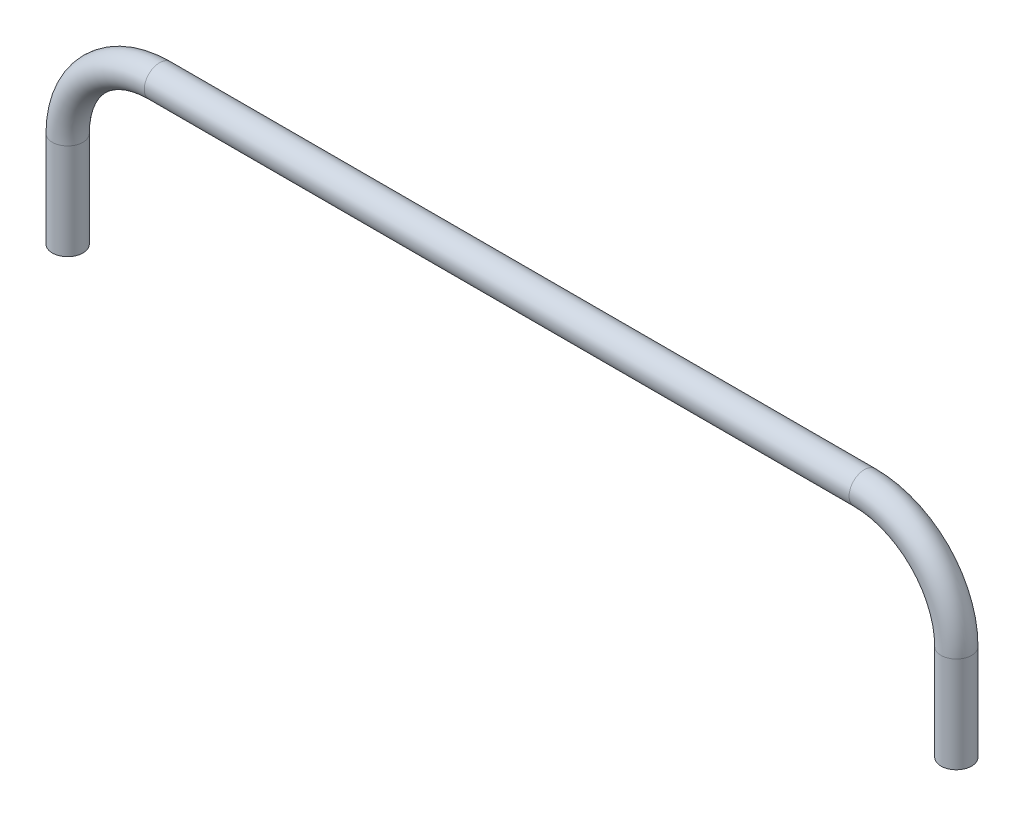
ISO-10303-21;
HEADER;
FILE_DESCRIPTION(('STEP AP214'),'2;1');
FILE_NAME('part.step','',(''),(''),'','','');
FILE_SCHEMA(('AUTOMOTIVE_DESIGN { 1 0 10303 214 1 1 1 1 }'));
ENDSEC;
DATA;
#1=APPLICATION_CONTEXT('core data for automotive mechanical design processes');
#2=APPLICATION_PROTOCOL_DEFINITION('international standard','automotive_design',2000,#1);
#3=PRODUCT_CONTEXT('',#1,'mechanical');
#4=PRODUCT('Part','Part','',(#3));
#5=PRODUCT_RELATED_PRODUCT_CATEGORY('part','',(#4));
#6=PRODUCT_DEFINITION_FORMATION('','',#4);
#7=PRODUCT_DEFINITION_CONTEXT('part definition',#1,'design');
#8=PRODUCT_DEFINITION('design','',#6,#7);
#9=PRODUCT_DEFINITION_SHAPE('','',#8);
#10=(LENGTH_UNIT() NAMED_UNIT(*) SI_UNIT(.MILLI.,.METRE.));
#11=(NAMED_UNIT(*) PLANE_ANGLE_UNIT() SI_UNIT($,.RADIAN.));
#12=(NAMED_UNIT(*) SI_UNIT($,.STERADIAN.) SOLID_ANGLE_UNIT());
#13=UNCERTAINTY_MEASURE_WITH_UNIT(LENGTH_MEASURE(1.E-05),#10,'distance_accuracy_value','');
#14=(GEOMETRIC_REPRESENTATION_CONTEXT(3) GLOBAL_UNCERTAINTY_ASSIGNED_CONTEXT((#13)) GLOBAL_UNIT_ASSIGNED_CONTEXT((#10,
#11,#12)) REPRESENTATION_CONTEXT('',''));
#15=CARTESIAN_POINT('',(0.,0.,0.));
#16=DIRECTION('',(0.,0.,1.));
#17=DIRECTION('',(1.,0.,0.));
#18=AXIS2_PLACEMENT_3D('',#15,#16,#17);
#19=CARTESIAN_POINT('',(0.,0.,0.));
#20=DIRECTION('',(0.,1.,0.));
#21=DIRECTION('',(0.,0.,1.));
#22=AXIS2_PLACEMENT_3D('',#19,#20,#21);
#23=CYLINDRICAL_SURFACE('',#22,12.7);
#24=CARTESIAN_POINT('',(0.,79.502,0.));
#25=DIRECTION('',(0.,1.,0.));
#26=DIRECTION('',(0.,0.,1.));
#27=AXIS2_PLACEMENT_3D('',#24,#25,#26);
#28=CIRCLE('',#27,12.7);
#29=CARTESIAN_POINT('',(-12.7,79.502,0.));
#30=VERTEX_POINT('',#29);
#31=EDGE_CURVE('E96',#30,#30,#28,.T.);
#32=ORIENTED_EDGE('',*,*,#31,.F.);
#33=EDGE_LOOP('',(#32));
#34=FACE_BOUND('',#33,.T.);
#35=CARTESIAN_POINT('',(0.,0.,0.));
#36=DIRECTION('',(0.,1.,0.));
#37=DIRECTION('',(0.,0.,1.));
#38=AXIS2_PLACEMENT_3D('',#35,#36,#37);
#39=CIRCLE('',#38,12.7);
#40=CARTESIAN_POINT('',(0.,0.,12.7));
#41=VERTEX_POINT('',#40);
#42=EDGE_CURVE('E63',#41,#41,#39,.T.);
#43=ORIENTED_EDGE('',*,*,#42,.T.);
#44=EDGE_LOOP('',(#43));
#45=FACE_BOUND('',#44,.T.);
#46=ADVANCED_FACE('F48',(#34,#45),#23,.T.);
#47=CARTESIAN_POINT('',(76.2,79.502,0.));
#48=DIRECTION('',(0.,0.,-1.));
#49=DIRECTION('',(-1.,0.,0.));
#50=AXIS2_PLACEMENT_3D('',#47,#48,#49);
#51=TOROIDAL_SURFACE('',#50,76.2,12.7);
#52=CARTESIAN_POINT('',(76.2,155.702,0.));
#53=DIRECTION('',(1.,0.,0.));
#54=DIRECTION('',(0.,0.,1.));
#55=AXIS2_PLACEMENT_3D('',#52,#53,#54);
#56=CIRCLE('',#55,12.7);
#57=CARTESIAN_POINT('',(76.2,168.402,0.));
#58=VERTEX_POINT('',#57);
#59=EDGE_CURVE('E99',#58,#58,#56,.T.);
#60=CARTESIAN_POINT('',(76.2,79.502,0.));
#61=DIRECTION('',(0.,0.,-1.));
#62=DIRECTION('',(-1.,0.,0.));
#63=AXIS2_PLACEMENT_3D('',#60,#61,#62);
#64=CIRCLE('',#63,88.9);
#65=EDGE_CURVE('',#30,#58,#64,.T.);
#66=ORIENTED_EDGE('',*,*,#31,.T.);
#67=ORIENTED_EDGE('',*,*,#59,.F.);
#68=ORIENTED_EDGE('',*,*,#65,.T.);
#69=ORIENTED_EDGE('',*,*,#65,.F.);
#70=EDGE_LOOP('',(#66,#68,#67,#69));
#71=FACE_BOUND('',#70,.T.);
#72=ADVANCED_FACE('F117',(#71),#51,.T.);
#73=CARTESIAN_POINT('',(76.2,155.702,0.));
#74=DIRECTION('',(1.,0.,0.));
#75=DIRECTION('',(0.,0.,-1.));
#76=AXIS2_PLACEMENT_3D('',#73,#74,#75);
#77=CYLINDRICAL_SURFACE('',#76,12.7);
#78=CARTESIAN_POINT('',(660.4,155.702,0.));
#79=DIRECTION('',(1.,0.,0.));
#80=DIRECTION('',(0.,0.,1.));
#81=AXIS2_PLACEMENT_3D('',#78,#79,#80);
#82=CIRCLE('',#81,12.7);
#83=CARTESIAN_POINT('',(660.4,168.402,0.));
#84=VERTEX_POINT('',#83);
#85=EDGE_CURVE('E101',#84,#84,#82,.T.);
#86=ORIENTED_EDGE('',*,*,#85,.F.);
#87=EDGE_LOOP('',(#86));
#88=FACE_BOUND('',#87,.T.);
#89=ORIENTED_EDGE('',*,*,#59,.T.);
#90=EDGE_LOOP('',(#89));
#91=FACE_BOUND('',#90,.T.);
#92=ADVANCED_FACE('F111',(#88,#91),#77,.T.);
#93=CARTESIAN_POINT('',(660.4,79.502,0.));
#94=DIRECTION('',(0.,0.,-1.));
#95=DIRECTION('',(-1.,0.,0.));
#96=AXIS2_PLACEMENT_3D('',#93,#94,#95);
#97=TOROIDAL_SURFACE('',#96,76.2000000000001,12.7);
#98=CARTESIAN_POINT('',(736.6,79.502,0.));
#99=DIRECTION('',(0.,-1.,0.));
#100=DIRECTION('',(0.,0.,1.));
#101=AXIS2_PLACEMENT_3D('',#98,#99,#100);
#102=CIRCLE('',#101,12.7);
#103=CARTESIAN_POINT('',(749.3,79.502,0.));
#104=VERTEX_POINT('',#103);
#105=EDGE_CURVE('E52',#104,#104,#102,.T.);
#106=CARTESIAN_POINT('',(660.4,79.502,0.));
#107=DIRECTION('',(0.,0.,-1.));
#108=DIRECTION('',(-1.,0.,0.));
#109=AXIS2_PLACEMENT_3D('',#106,#107,#108);
#110=CIRCLE('',#109,88.9000000000001);
#111=EDGE_CURVE('',#84,#104,#110,.T.);
#112=ORIENTED_EDGE('',*,*,#85,.T.);
#113=ORIENTED_EDGE('',*,*,#105,.F.);
#114=ORIENTED_EDGE('',*,*,#111,.T.);
#115=ORIENTED_EDGE('',*,*,#111,.F.);
#116=EDGE_LOOP('',(#112,#114,#113,#115));
#117=FACE_BOUND('',#116,.T.);
#118=ADVANCED_FACE('F109',(#117),#97,.T.);
#119=CARTESIAN_POINT('',(736.6,79.502,0.));
#120=DIRECTION('',(0.,-1.,0.));
#121=DIRECTION('',(1.,0.,0.));
#122=AXIS2_PLACEMENT_3D('',#119,#120,#121);
#123=CYLINDRICAL_SURFACE('',#122,12.7);
#124=CARTESIAN_POINT('',(736.6,0.,0.));
#125=DIRECTION('',(0.,-1.,0.));
#126=DIRECTION('',(0.,0.,1.));
#127=AXIS2_PLACEMENT_3D('',#124,#125,#126);
#128=CIRCLE('',#127,12.7);
#129=CARTESIAN_POINT('',(736.6,0.,12.7));
#130=VERTEX_POINT('',#129);
#131=EDGE_CURVE('E68',#130,#130,#128,.T.);
#132=ORIENTED_EDGE('',*,*,#131,.F.);
#133=EDGE_LOOP('',(#132));
#134=FACE_BOUND('',#133,.T.);
#135=ORIENTED_EDGE('',*,*,#105,.T.);
#136=EDGE_LOOP('',(#135));
#137=FACE_BOUND('',#136,.T.);
#138=ADVANCED_FACE('F50',(#134,#137),#123,.T.);
#139=CARTESIAN_POINT('',(0.,0.,0.));
#140=DIRECTION('',(0.,1.,0.));
#141=DIRECTION('',(0.,0.,1.));
#142=AXIS2_PLACEMENT_3D('',#139,#140,#141);
#143=PLANE('',#142);
#144=CARTESIAN_POINT('',(0.,0.,0.));
#145=DIRECTION('',(0.,1.,0.));
#146=DIRECTION('',(0.,0.,1.));
#147=AXIS2_PLACEMENT_3D('',#144,#145,#146);
#148=CIRCLE('',#147,8.73125);
#149=CARTESIAN_POINT('',(0.,0.,8.73125));
#150=VERTEX_POINT('',#149);
#151=EDGE_CURVE('E94',#150,#150,#148,.F.);
#152=ORIENTED_EDGE('',*,*,#151,.F.);
#153=EDGE_LOOP('',(#152));
#154=FACE_BOUND('',#153,.T.);
#155=ORIENTED_EDGE('',*,*,#42,.F.);
#156=EDGE_LOOP('',(#155));
#157=FACE_BOUND('',#156,.T.);
#158=ADVANCED_FACE('F116',(#154,#157),#143,.F.);
#159=CARTESIAN_POINT('',(736.6,0.,0.));
#160=DIRECTION('',(0.,-1.,0.));
#161=DIRECTION('',(0.,0.,1.));
#162=AXIS2_PLACEMENT_3D('',#159,#160,#161);
#163=PLANE('',#162);
#164=CARTESIAN_POINT('',(736.6,0.,0.));
#165=DIRECTION('',(0.,-1.,0.));
#166=DIRECTION('',(0.,0.,1.));
#167=AXIS2_PLACEMENT_3D('',#164,#165,#166);
#168=CIRCLE('',#167,8.73125);
#169=CARTESIAN_POINT('',(736.6,0.,8.73125));
#170=VERTEX_POINT('',#169);
#171=EDGE_CURVE('E13',#170,#170,#168,.F.);
#172=ORIENTED_EDGE('',*,*,#171,.T.);
#173=EDGE_LOOP('',(#172));
#174=FACE_BOUND('',#173,.T.);
#175=ORIENTED_EDGE('',*,*,#131,.T.);
#176=EDGE_LOOP('',(#175));
#177=FACE_BOUND('',#176,.T.);
#178=ADVANCED_FACE('F75',(#174,#177),#163,.T.);
#179=CARTESIAN_POINT('',(0.,0.,0.));
#180=DIRECTION('',(0.,1.,0.));
#181=DIRECTION('',(0.,0.,1.));
#182=AXIS2_PLACEMENT_3D('',#179,#180,#181);
#183=CYLINDRICAL_SURFACE('',#182,8.73125);
#184=CARTESIAN_POINT('',(0.,79.502,0.));
#185=DIRECTION('',(0.,1.,0.));
#186=DIRECTION('',(0.,0.,1.));
#187=AXIS2_PLACEMENT_3D('',#184,#185,#186);
#188=CIRCLE('',#187,8.73125);
#189=CARTESIAN_POINT('',(-8.73125,79.502,0.));
#190=VERTEX_POINT('',#189);
#191=EDGE_CURVE('E150',#190,#190,#188,.F.);
#192=ORIENTED_EDGE('',*,*,#191,.F.);
#193=EDGE_LOOP('',(#192));
#194=FACE_BOUND('',#193,.T.);
#195=ORIENTED_EDGE('',*,*,#151,.T.);
#196=EDGE_LOOP('',(#195));
#197=FACE_BOUND('',#196,.T.);
#198=ADVANCED_FACE('F131',(#194,#197),#183,.F.);
#199=CARTESIAN_POINT('',(76.2,79.502,0.));
#200=DIRECTION('',(0.,0.,-1.));
#201=DIRECTION('',(-1.,0.,0.));
#202=AXIS2_PLACEMENT_3D('',#199,#200,#201);
#203=TOROIDAL_SURFACE('',#202,76.2,8.73125);
#204=CARTESIAN_POINT('',(76.2,155.702,0.));
#205=DIRECTION('',(1.,0.,0.));
#206=DIRECTION('',(0.,0.,1.));
#207=AXIS2_PLACEMENT_3D('',#204,#205,#206);
#208=CIRCLE('',#207,8.73125);
#209=CARTESIAN_POINT('',(76.2,164.43325,0.));
#210=VERTEX_POINT('',#209);
#211=EDGE_CURVE('E89',#210,#210,#208,.F.);
#212=CARTESIAN_POINT('',(76.2,79.502,0.));
#213=DIRECTION('',(0.,0.,-1.));
#214=DIRECTION('',(-1.,0.,0.));
#215=AXIS2_PLACEMENT_3D('',#212,#213,#214);
#216=CIRCLE('',#215,84.93125);
#217=EDGE_CURVE('',#190,#210,#216,.T.);
#218=ORIENTED_EDGE('',*,*,#191,.T.);
#219=ORIENTED_EDGE('',*,*,#211,.F.);
#220=ORIENTED_EDGE('',*,*,#217,.T.);
#221=ORIENTED_EDGE('',*,*,#217,.F.);
#222=EDGE_LOOP('',(#218,#220,#219,#221));
#223=FACE_BOUND('',#222,.T.);
#224=ADVANCED_FACE('F138',(#223),#203,.F.);
#225=CARTESIAN_POINT('',(76.2,155.702,0.));
#226=DIRECTION('',(1.,0.,0.));
#227=DIRECTION('',(0.,0.,-1.));
#228=AXIS2_PLACEMENT_3D('',#225,#226,#227);
#229=CYLINDRICAL_SURFACE('',#228,8.73125);
#230=CARTESIAN_POINT('',(660.4,155.702,0.));
#231=DIRECTION('',(1.,0.,0.));
#232=DIRECTION('',(0.,0.,1.));
#233=AXIS2_PLACEMENT_3D('',#230,#231,#232);
#234=CIRCLE('',#233,8.73125);
#235=CARTESIAN_POINT('',(660.4,164.43325,0.));
#236=VERTEX_POINT('',#235);
#237=EDGE_CURVE('E86',#236,#236,#234,.F.);
#238=ORIENTED_EDGE('',*,*,#237,.F.);
#239=EDGE_LOOP('',(#238));
#240=FACE_BOUND('',#239,.T.);
#241=ORIENTED_EDGE('',*,*,#211,.T.);
#242=EDGE_LOOP('',(#241));
#243=FACE_BOUND('',#242,.T.);
#244=ADVANCED_FACE('F135',(#240,#243),#229,.F.);
#245=CARTESIAN_POINT('',(660.4,79.502,0.));
#246=DIRECTION('',(0.,0.,-1.));
#247=DIRECTION('',(-1.,0.,0.));
#248=AXIS2_PLACEMENT_3D('',#245,#246,#247);
#249=TOROIDAL_SURFACE('',#248,76.2000000000001,8.73125);
#250=CARTESIAN_POINT('',(736.6,79.502,0.));
#251=DIRECTION('',(0.,-1.,0.));
#252=DIRECTION('',(0.,0.,1.));
#253=AXIS2_PLACEMENT_3D('',#250,#251,#252);
#254=CIRCLE('',#253,8.73125);
#255=CARTESIAN_POINT('',(745.33125,79.502,0.));
#256=VERTEX_POINT('',#255);
#257=EDGE_CURVE('E57',#256,#256,#254,.F.);
#258=CARTESIAN_POINT('',(660.4,79.502,0.));
#259=DIRECTION('',(0.,0.,-1.));
#260=DIRECTION('',(-1.,0.,0.));
#261=AXIS2_PLACEMENT_3D('',#258,#259,#260);
#262=CIRCLE('',#261,84.93125);
#263=EDGE_CURVE('',#236,#256,#262,.T.);
#264=ORIENTED_EDGE('',*,*,#237,.T.);
#265=ORIENTED_EDGE('',*,*,#257,.F.);
#266=ORIENTED_EDGE('',*,*,#263,.T.);
#267=ORIENTED_EDGE('',*,*,#263,.F.);
#268=EDGE_LOOP('',(#264,#266,#265,#267));
#269=FACE_BOUND('',#268,.T.);
#270=ADVANCED_FACE('F81',(#269),#249,.F.);
#271=CARTESIAN_POINT('',(736.6,79.502,0.));
#272=DIRECTION('',(0.,-1.,0.));
#273=DIRECTION('',(1.,0.,0.));
#274=AXIS2_PLACEMENT_3D('',#271,#272,#273);
#275=CYLINDRICAL_SURFACE('',#274,8.73125);
#276=ORIENTED_EDGE('',*,*,#171,.F.);
#277=EDGE_LOOP('',(#276));
#278=FACE_BOUND('',#277,.T.);
#279=ORIENTED_EDGE('',*,*,#257,.T.);
#280=EDGE_LOOP('',(#279));
#281=FACE_BOUND('',#280,.T.);
#282=ADVANCED_FACE('F78',(#278,#281),#275,.F.);
#283=CLOSED_SHELL('',(#46,#72,#92,#118,#138,#158,#178,#198,#224,#244,#270,#282));
#284=MANIFOLD_SOLID_BREP('B2',#283);
#285=ADVANCED_BREP_SHAPE_REPRESENTATION('',(#18,#284),#14);
#286=SHAPE_DEFINITION_REPRESENTATION(#9,#285);
ENDSEC;
END-ISO-10303-21;
